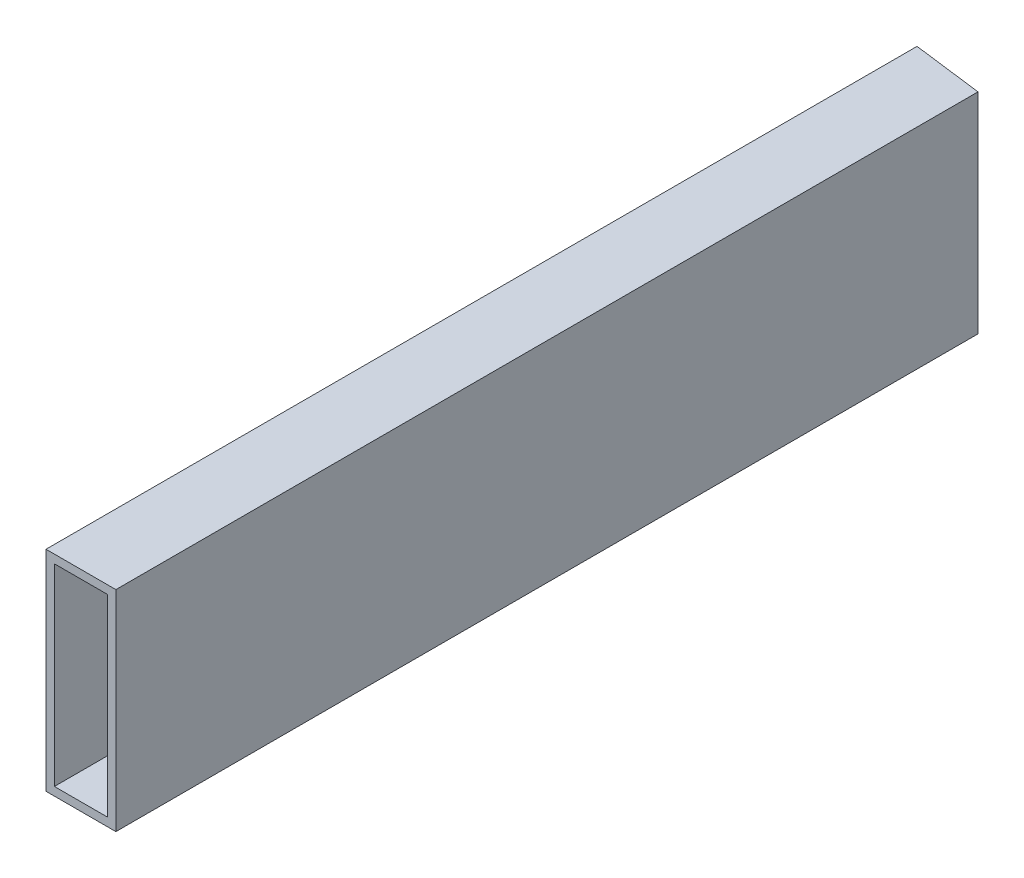
ISO-10303-21;
HEADER;
FILE_DESCRIPTION(('STEP AP214'),'2;1');
FILE_NAME('part.step','',(''),(''),'','','');
FILE_SCHEMA(('AUTOMOTIVE_DESIGN { 1 0 10303 214 1 1 1 1 }'));
ENDSEC;
DATA;
#1=APPLICATION_CONTEXT('core data for automotive mechanical design processes');
#2=APPLICATION_PROTOCOL_DEFINITION('international standard','automotive_design',2000,#1);
#3=PRODUCT_CONTEXT('',#1,'mechanical');
#4=PRODUCT('Part','Part','',(#3));
#5=PRODUCT_RELATED_PRODUCT_CATEGORY('part','',(#4));
#6=PRODUCT_DEFINITION_FORMATION('','',#4);
#7=PRODUCT_DEFINITION_CONTEXT('part definition',#1,'design');
#8=PRODUCT_DEFINITION('design','',#6,#7);
#9=PRODUCT_DEFINITION_SHAPE('','',#8);
#10=(LENGTH_UNIT() NAMED_UNIT(*) SI_UNIT(.MILLI.,.METRE.));
#11=(NAMED_UNIT(*) PLANE_ANGLE_UNIT() SI_UNIT($,.RADIAN.));
#12=(NAMED_UNIT(*) SI_UNIT($,.STERADIAN.) SOLID_ANGLE_UNIT());
#13=UNCERTAINTY_MEASURE_WITH_UNIT(LENGTH_MEASURE(1.E-05),#10,'distance_accuracy_value','');
#14=(GEOMETRIC_REPRESENTATION_CONTEXT(3) GLOBAL_UNCERTAINTY_ASSIGNED_CONTEXT((#13)) GLOBAL_UNIT_ASSIGNED_CONTEXT((#10,
#11,#12)) REPRESENTATION_CONTEXT('',''));
#15=CARTESIAN_POINT('',(0.,0.,0.));
#16=DIRECTION('',(0.,0.,1.));
#17=DIRECTION('',(1.,0.,0.));
#18=AXIS2_PLACEMENT_3D('',#15,#16,#17);
#19=CARTESIAN_POINT('',(12.7000000000001,0.,315.));
#20=DIRECTION('',(-1.,0.,0.));
#21=DIRECTION('',(0.,-1.,0.));
#22=AXIS2_PLACEMENT_3D('',#19,#20,#21);
#23=PLANE('',#22);
#24=DIRECTION('',(0.,-1.,0.));
#25=VECTOR('',#24,1.);
#26=CARTESIAN_POINT('',(12.7000000000001,0.,1.61764451062468));
#27=LINE('',#26,#25);
#28=CARTESIAN_POINT('',(12.7,38.1,1.61764451062467));
#29=VERTEX_POINT('',#28);
#30=CARTESIAN_POINT('',(12.7,-38.1,1.61764451062468));
#31=VERTEX_POINT('',#30);
#32=EDGE_CURVE('E59',#29,#31,#27,.T.);
#33=ORIENTED_EDGE('',*,*,#32,.F.);
#34=DIRECTION('',(0.,0.,-1.));
#35=VECTOR('',#34,1.);
#36=CARTESIAN_POINT('',(12.7,38.1,315.));
#37=LINE('',#36,#35);
#38=CARTESIAN_POINT('',(12.7,38.1,315.));
#39=VERTEX_POINT('',#38);
#40=EDGE_CURVE('E11',#39,#29,#37,.T.);
#41=ORIENTED_EDGE('',*,*,#40,.F.);
#42=DIRECTION('',(0.,1.,0.));
#43=VECTOR('',#42,1.);
#44=CARTESIAN_POINT('',(12.7000000000001,0.,315.));
#45=LINE('',#44,#43);
#46=CARTESIAN_POINT('',(12.7,-38.1,315.));
#47=VERTEX_POINT('',#46);
#48=EDGE_CURVE('E162',#47,#39,#45,.T.);
#49=ORIENTED_EDGE('',*,*,#48,.F.);
#50=DIRECTION('',(0.,0.,-1.));
#51=VECTOR('',#50,1.);
#52=CARTESIAN_POINT('',(12.7,-38.1,315.));
#53=LINE('',#52,#51);
#54=EDGE_CURVE('E120',#47,#31,#53,.T.);
#55=ORIENTED_EDGE('',*,*,#54,.T.);
#56=EDGE_LOOP('',(#33,#41,#49,#55));
#57=FACE_BOUND('',#56,.T.);
#58=ADVANCED_FACE('F34',(#57),#23,.F.);
#59=CARTESIAN_POINT('',(0.,38.1,315.));
#60=DIRECTION('',(0.,1.,0.));
#61=DIRECTION('',(0.,0.,1.));
#62=AXIS2_PLACEMENT_3D('',#59,#60,#61);
#63=PLANE('',#62);
#64=ORIENTED_EDGE('',*,*,#40,.T.);
#65=DIRECTION('',(-0.991985376438617,0.,-0.126352732190228));
#66=VECTOR('',#65,1.);
#67=CARTESIAN_POINT('',(39.4821197208178,38.1,5.02897907355965));
#68=LINE('',#67,#66);
#69=CARTESIAN_POINT('',(-12.7,38.1,-1.61764451062468));
#70=VERTEX_POINT('',#69);
#71=EDGE_CURVE('E114',#29,#70,#68,.T.);
#72=ORIENTED_EDGE('',*,*,#71,.T.);
#73=DIRECTION('',(0.,0.,-1.));
#74=VECTOR('',#73,1.);
#75=CARTESIAN_POINT('',(-12.7,38.1,315.));
#76=LINE('',#75,#74);
#77=CARTESIAN_POINT('',(-12.7,38.1,315.));
#78=VERTEX_POINT('',#77);
#79=EDGE_CURVE('E43',#78,#70,#76,.T.);
#80=ORIENTED_EDGE('',*,*,#79,.F.);
#81=DIRECTION('',(1.,0.,0.));
#82=VECTOR('',#81,1.);
#83=CARTESIAN_POINT('',(0.,38.1,315.));
#84=LINE('',#83,#82);
#85=EDGE_CURVE('E164',#78,#39,#84,.T.);
#86=ORIENTED_EDGE('',*,*,#85,.T.);
#87=EDGE_LOOP('',(#64,#72,#80,#86));
#88=FACE_BOUND('',#87,.T.);
#89=ADVANCED_FACE('F174',(#88),#63,.T.);
#90=CARTESIAN_POINT('',(-12.7,0.,315.));
#91=DIRECTION('',(-1.,0.,0.));
#92=DIRECTION('',(0.,0.,1.));
#93=AXIS2_PLACEMENT_3D('',#90,#91,#92);
#94=PLANE('',#93);
#95=ORIENTED_EDGE('',*,*,#79,.T.);
#96=DIRECTION('',(0.,-1.,0.));
#97=VECTOR('',#96,1.);
#98=CARTESIAN_POINT('',(-12.7,0.,-1.61764451062468));
#99=LINE('',#98,#97);
#100=CARTESIAN_POINT('',(-12.7,-38.1,-1.61764451062469));
#101=VERTEX_POINT('',#100);
#102=EDGE_CURVE('E101',#70,#101,#99,.T.);
#103=ORIENTED_EDGE('',*,*,#102,.T.);
#104=DIRECTION('',(0.,0.,-1.));
#105=VECTOR('',#104,1.);
#106=CARTESIAN_POINT('',(-12.7,-38.1,315.));
#107=LINE('',#106,#105);
#108=CARTESIAN_POINT('',(-12.7,-38.1,315.));
#109=VERTEX_POINT('',#108);
#110=EDGE_CURVE('E112',#109,#101,#107,.T.);
#111=ORIENTED_EDGE('',*,*,#110,.F.);
#112=DIRECTION('',(0.,1.,0.));
#113=VECTOR('',#112,1.);
#114=CARTESIAN_POINT('',(-12.7,0.,315.));
#115=LINE('',#114,#113);
#116=EDGE_CURVE('E167',#109,#78,#115,.T.);
#117=ORIENTED_EDGE('',*,*,#116,.T.);
#118=EDGE_LOOP('',(#95,#103,#111,#117));
#119=FACE_BOUND('',#118,.T.);
#120=ADVANCED_FACE('F110',(#119),#94,.T.);
#121=CARTESIAN_POINT('',(9.652,0.,315.));
#122=DIRECTION('',(1.,0.,0.));
#123=DIRECTION('',(0.,1.,0.));
#124=AXIS2_PLACEMENT_3D('',#121,#122,#123);
#125=PLANE('',#124);
#126=DIRECTION('',(0.,1.,0.));
#127=VECTOR('',#126,1.);
#128=CARTESIAN_POINT('',(9.652,0.,1.22940982807473));
#129=LINE('',#128,#127);
#130=CARTESIAN_POINT('',(9.652,-35.052,1.22940982807475));
#131=VERTEX_POINT('',#130);
#132=CARTESIAN_POINT('',(9.65199999999999,35.052,1.22940982807474));
#133=VERTEX_POINT('',#132);
#134=EDGE_CURVE('E51',#131,#133,#129,.T.);
#135=ORIENTED_EDGE('',*,*,#134,.F.);
#136=DIRECTION('',(0.,0.,-1.));
#137=VECTOR('',#136,1.);
#138=CARTESIAN_POINT('',(9.652,-35.052,315.));
#139=LINE('',#138,#137);
#140=CARTESIAN_POINT('',(9.652,-35.052,315.));
#141=VERTEX_POINT('',#140);
#142=EDGE_CURVE('E38',#141,#131,#139,.T.);
#143=ORIENTED_EDGE('',*,*,#142,.F.);
#144=DIRECTION('',(0.,-1.,0.));
#145=VECTOR('',#144,1.);
#146=CARTESIAN_POINT('',(9.652,0.,315.));
#147=LINE('',#146,#145);
#148=CARTESIAN_POINT('',(9.65199999999999,35.052,315.));
#149=VERTEX_POINT('',#148);
#150=EDGE_CURVE('E147',#149,#141,#147,.T.);
#151=ORIENTED_EDGE('',*,*,#150,.F.);
#152=DIRECTION('',(0.,0.,-1.));
#153=VECTOR('',#152,1.);
#154=CARTESIAN_POINT('',(9.65199999999999,35.052,315.));
#155=LINE('',#154,#153);
#156=EDGE_CURVE('E126',#149,#133,#155,.T.);
#157=ORIENTED_EDGE('',*,*,#156,.T.);
#158=EDGE_LOOP('',(#135,#143,#151,#157));
#159=FACE_BOUND('',#158,.T.);
#160=ADVANCED_FACE('F36',(#159),#125,.F.);
#161=CARTESIAN_POINT('',(0.,-35.052,315.));
#162=DIRECTION('',(0.,1.,0.));
#163=DIRECTION('',(-1.,0.,0.));
#164=AXIS2_PLACEMENT_3D('',#161,#162,#163);
#165=PLANE('',#164);
#166=ORIENTED_EDGE('',*,*,#142,.T.);
#167=DIRECTION('',(-0.991985376438617,0.,-0.126352732190228));
#168=VECTOR('',#167,1.);
#169=CARTESIAN_POINT('',(39.4821197208178,-35.052,5.02897907355965));
#170=LINE('',#169,#168);
#171=CARTESIAN_POINT('',(-9.65199999999999,-35.052,-1.22940982807473));
#172=VERTEX_POINT('',#171);
#173=EDGE_CURVE('E142',#131,#172,#170,.T.);
#174=ORIENTED_EDGE('',*,*,#173,.T.);
#175=DIRECTION('',(0.,0.,-1.));
#176=VECTOR('',#175,1.);
#177=CARTESIAN_POINT('',(-9.65199999999999,-35.052,315.));
#178=LINE('',#177,#176);
#179=CARTESIAN_POINT('',(-9.65199999999999,-35.052,315.));
#180=VERTEX_POINT('',#179);
#181=EDGE_CURVE('E131',#180,#172,#178,.T.);
#182=ORIENTED_EDGE('',*,*,#181,.F.);
#183=DIRECTION('',(1.,0.,0.));
#184=VECTOR('',#183,1.);
#185=CARTESIAN_POINT('',(0.,-35.052,315.));
#186=LINE('',#185,#184);
#187=EDGE_CURVE('E144',#180,#141,#186,.T.);
#188=ORIENTED_EDGE('',*,*,#187,.T.);
#189=EDGE_LOOP('',(#166,#174,#182,#188));
#190=FACE_BOUND('',#189,.T.);
#191=ADVANCED_FACE('F141',(#190),#165,.T.);
#192=CARTESIAN_POINT('',(-9.65199999999999,0.,315.));
#193=DIRECTION('',(1.,0.,0.));
#194=DIRECTION('',(0.,1.,0.));
#195=AXIS2_PLACEMENT_3D('',#192,#193,#194);
#196=PLANE('',#195);
#197=ORIENTED_EDGE('',*,*,#181,.T.);
#198=DIRECTION('',(0.,1.,0.));
#199=VECTOR('',#198,1.);
#200=CARTESIAN_POINT('',(-9.65199999999999,0.,-1.22940982807473));
#201=LINE('',#200,#199);
#202=CARTESIAN_POINT('',(-9.65199999999999,35.052,-1.22940982807478));
#203=VERTEX_POINT('',#202);
#204=EDGE_CURVE('E150',#172,#203,#201,.T.);
#205=ORIENTED_EDGE('',*,*,#204,.T.);
#206=DIRECTION('',(0.,0.,-1.));
#207=VECTOR('',#206,1.);
#208=CARTESIAN_POINT('',(-9.65199999999999,35.052,315.));
#209=LINE('',#208,#207);
#210=CARTESIAN_POINT('',(-9.65199999999999,35.052,315.));
#211=VERTEX_POINT('',#210);
#212=EDGE_CURVE('E129',#211,#203,#209,.T.);
#213=ORIENTED_EDGE('',*,*,#212,.F.);
#214=DIRECTION('',(0.,-1.,0.));
#215=VECTOR('',#214,1.);
#216=CARTESIAN_POINT('',(-9.65199999999999,0.,315.));
#217=LINE('',#216,#215);
#218=EDGE_CURVE('E158',#211,#180,#217,.T.);
#219=ORIENTED_EDGE('',*,*,#218,.T.);
#220=EDGE_LOOP('',(#197,#205,#213,#219));
#221=FACE_BOUND('',#220,.T.);
#222=ADVANCED_FACE('F187',(#221),#196,.T.);
#223=CARTESIAN_POINT('',(0.,35.052,315.));
#224=DIRECTION('',(0.,1.,0.));
#225=DIRECTION('',(0.,0.,1.));
#226=AXIS2_PLACEMENT_3D('',#223,#224,#225);
#227=PLANE('',#226);
#228=DIRECTION('',(-0.991985376438617,0.,-0.126352732190228));
#229=VECTOR('',#228,1.);
#230=CARTESIAN_POINT('',(39.4821197208178,35.052,5.02897907355965));
#231=LINE('',#230,#229);
#232=EDGE_CURVE('E106',#133,#203,#231,.T.);
#233=ORIENTED_EDGE('',*,*,#232,.F.);
#234=ORIENTED_EDGE('',*,*,#156,.F.);
#235=DIRECTION('',(1.,0.,0.));
#236=VECTOR('',#235,1.);
#237=CARTESIAN_POINT('',(0.,35.052,315.));
#238=LINE('',#237,#236);
#239=EDGE_CURVE('E160',#211,#149,#238,.T.);
#240=ORIENTED_EDGE('',*,*,#239,.F.);
#241=ORIENTED_EDGE('',*,*,#212,.T.);
#242=EDGE_LOOP('',(#233,#234,#240,#241));
#243=FACE_BOUND('',#242,.T.);
#244=ADVANCED_FACE('F184',(#243),#227,.F.);
#245=CARTESIAN_POINT('',(0.,-38.1,315.));
#246=DIRECTION('',(0.,-1.,0.));
#247=DIRECTION('',(0.,0.,-1.));
#248=AXIS2_PLACEMENT_3D('',#245,#246,#247);
#249=PLANE('',#248);
#250=ORIENTED_EDGE('',*,*,#110,.T.);
#251=DIRECTION('',(-0.991985376438617,0.,-0.126352732190228));
#252=VECTOR('',#251,1.);
#253=CARTESIAN_POINT('',(0.,-38.1,0.));
#254=LINE('',#253,#252);
#255=EDGE_CURVE('E98',#31,#101,#254,.T.);
#256=ORIENTED_EDGE('',*,*,#255,.F.);
#257=ORIENTED_EDGE('',*,*,#54,.F.);
#258=DIRECTION('',(-1.,0.,0.));
#259=VECTOR('',#258,1.);
#260=CARTESIAN_POINT('',(0.,-38.1,315.));
#261=LINE('',#260,#259);
#262=EDGE_CURVE('E119',#47,#109,#261,.T.);
#263=ORIENTED_EDGE('',*,*,#262,.T.);
#264=EDGE_LOOP('',(#250,#256,#257,#263));
#265=FACE_BOUND('',#264,.T.);
#266=ADVANCED_FACE('F117',(#265),#249,.T.);
#267=CARTESIAN_POINT('',(0.,0.,315.));
#268=DIRECTION('',(0.,0.,1.));
#269=DIRECTION('',(1.,0.,0.));
#270=AXIS2_PLACEMENT_3D('',#267,#268,#269);
#271=PLANE('',#270);
#272=ORIENTED_EDGE('',*,*,#150,.T.);
#273=ORIENTED_EDGE('',*,*,#187,.F.);
#274=ORIENTED_EDGE('',*,*,#218,.F.);
#275=ORIENTED_EDGE('',*,*,#239,.T.);
#276=EDGE_LOOP('',(#272,#273,#274,#275));
#277=FACE_BOUND('',#276,.T.);
#278=ORIENTED_EDGE('',*,*,#48,.T.);
#279=ORIENTED_EDGE('',*,*,#85,.F.);
#280=ORIENTED_EDGE('',*,*,#116,.F.);
#281=ORIENTED_EDGE('',*,*,#262,.F.);
#282=EDGE_LOOP('',(#278,#279,#280,#281));
#283=FACE_BOUND('',#282,.T.);
#284=ADVANCED_FACE('F170',(#277,#283),#271,.T.);
#285=CARTESIAN_POINT('',(0.,-38.1,0.));
#286=DIRECTION('',(0.126352732190228,0.,-0.991985376438617));
#287=DIRECTION('',(-0.991985376438617,0.,-0.126352732190228));
#288=AXIS2_PLACEMENT_3D('',#285,#286,#287);
#289=PLANE('',#288);
#290=ORIENTED_EDGE('',*,*,#134,.T.);
#291=ORIENTED_EDGE('',*,*,#232,.T.);
#292=ORIENTED_EDGE('',*,*,#204,.F.);
#293=ORIENTED_EDGE('',*,*,#173,.F.);
#294=EDGE_LOOP('',(#290,#291,#292,#293));
#295=FACE_BOUND('',#294,.T.);
#296=ORIENTED_EDGE('',*,*,#32,.T.);
#297=ORIENTED_EDGE('',*,*,#255,.T.);
#298=ORIENTED_EDGE('',*,*,#102,.F.);
#299=ORIENTED_EDGE('',*,*,#71,.F.);
#300=EDGE_LOOP('',(#296,#297,#298,#299));
#301=FACE_BOUND('',#300,.T.);
#302=ADVANCED_FACE('F100',(#295,#301),#289,.T.);
#303=CLOSED_SHELL('',(#58,#89,#120,#160,#191,#222,#244,#266,#284,#302));
#304=MANIFOLD_SOLID_BREP('B2',#303);
#305=ADVANCED_BREP_SHAPE_REPRESENTATION('',(#18,#304),#14);
#306=SHAPE_DEFINITION_REPRESENTATION(#9,#305);
ENDSEC;
END-ISO-10303-21;
